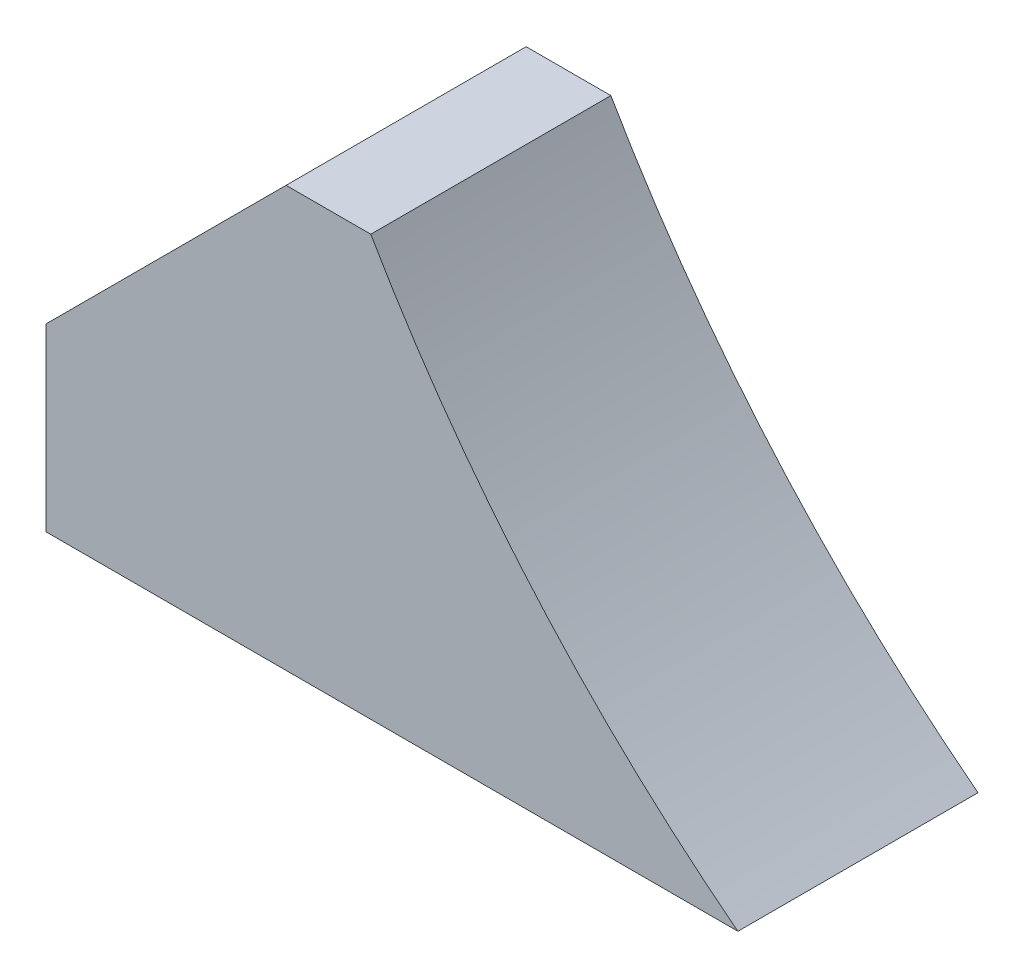
ISO-10303-21;
HEADER;
FILE_DESCRIPTION(('STEP AP214'),'2;1');
FILE_NAME('part.step','',(''),(''),'','','');
FILE_SCHEMA(('AUTOMOTIVE_DESIGN { 1 0 10303 214 1 1 1 1 }'));
ENDSEC;
DATA;
#1=APPLICATION_CONTEXT('core data for automotive mechanical design processes');
#2=APPLICATION_PROTOCOL_DEFINITION('international standard','automotive_design',2000,#1);
#3=PRODUCT_CONTEXT('',#1,'mechanical');
#4=PRODUCT('Part','Part','',(#3));
#5=PRODUCT_RELATED_PRODUCT_CATEGORY('part','',(#4));
#6=PRODUCT_DEFINITION_FORMATION('','',#4);
#7=PRODUCT_DEFINITION_CONTEXT('part definition',#1,'design');
#8=PRODUCT_DEFINITION('design','',#6,#7);
#9=PRODUCT_DEFINITION_SHAPE('','',#8);
#10=(LENGTH_UNIT() NAMED_UNIT(*) SI_UNIT(.MILLI.,.METRE.));
#11=(NAMED_UNIT(*) PLANE_ANGLE_UNIT() SI_UNIT($,.RADIAN.));
#12=(NAMED_UNIT(*) SI_UNIT($,.STERADIAN.) SOLID_ANGLE_UNIT());
#13=UNCERTAINTY_MEASURE_WITH_UNIT(LENGTH_MEASURE(1.E-05),#10,'distance_accuracy_value','');
#14=(GEOMETRIC_REPRESENTATION_CONTEXT(3) GLOBAL_UNCERTAINTY_ASSIGNED_CONTEXT((#13)) GLOBAL_UNIT_ASSIGNED_CONTEXT((#10,
#11,#12)) REPRESENTATION_CONTEXT('',''));
#15=CARTESIAN_POINT('',(0.,0.,0.));
#16=DIRECTION('',(0.,0.,1.));
#17=DIRECTION('',(1.,0.,0.));
#18=AXIS2_PLACEMENT_3D('',#15,#16,#17);
#19=CARTESIAN_POINT('',(64.758308061251,126.954794677147,-25.4));
#20=DIRECTION('',(0.,0.,1.));
#21=DIRECTION('',(1.,0.,0.));
#22=AXIS2_PLACEMENT_3D('',#19,#20,#21);
#23=CYLINDRICAL_SURFACE('',#22,152.390970058818);
#24=CARTESIAN_POINT('',(64.758308061251,126.954794677147,0.));
#25=DIRECTION('',(0.,0.,-1.));
#26=DIRECTION('',(-1.,0.,0.));
#27=AXIS2_PLACEMENT_3D('',#24,#25,#26);
#28=CIRCLE('',#27,152.390970058818);
#29=CARTESIAN_POINT('',(-28.3947447945238,6.35000000000004,0.));
#30=VERTEX_POINT('',#29);
#31=CARTESIAN_POINT('',(-67.2396275405953,50.8,0.));
#32=VERTEX_POINT('',#31);
#33=EDGE_CURVE('E110',#30,#32,#28,.T.);
#34=ORIENTED_EDGE('',*,*,#33,.F.);
#35=DIRECTION('',(0.,0.,1.));
#36=VECTOR('',#35,1.);
#37=CARTESIAN_POINT('',(-28.3947447945238,6.35000000000004,-25.4));
#38=LINE('',#37,#36);
#39=CARTESIAN_POINT('',(-28.3947447945238,6.35000000000004,-25.4));
#40=VERTEX_POINT('',#39);
#41=EDGE_CURVE('E101',#40,#30,#38,.T.);
#42=ORIENTED_EDGE('',*,*,#41,.F.);
#43=CARTESIAN_POINT('',(64.758308061251,126.954794677147,-25.4));
#44=DIRECTION('',(0.,0.,-1.));
#45=DIRECTION('',(-1.,0.,0.));
#46=AXIS2_PLACEMENT_3D('',#43,#44,#45);
#47=CIRCLE('',#46,152.390970058818);
#48=CARTESIAN_POINT('',(-67.2396275405953,50.8,-25.4));
#49=VERTEX_POINT('',#48);
#50=EDGE_CURVE('E96',#40,#49,#47,.T.);
#51=ORIENTED_EDGE('',*,*,#50,.T.);
#52=DIRECTION('',(0.,0.,1.));
#53=VECTOR('',#52,1.);
#54=CARTESIAN_POINT('',(-67.2396275405953,50.8,-25.4));
#55=LINE('',#54,#53);
#56=EDGE_CURVE('E78',#49,#32,#55,.T.);
#57=ORIENTED_EDGE('',*,*,#56,.T.);
#58=EDGE_LOOP('',(#34,#42,#51,#57));
#59=FACE_BOUND('',#58,.T.);
#60=ADVANCED_FACE('F33',(#59),#23,.F.);
#61=CARTESIAN_POINT('',(-28.3947447945238,6.35000000000004,-25.4));
#62=DIRECTION('',(0.,-1.,0.));
#63=DIRECTION('',(1.,0.,0.));
#64=AXIS2_PLACEMENT_3D('',#61,#62,#63);
#65=PLANE('',#64);
#66=DIRECTION('',(1.,0.,0.));
#67=VECTOR('',#66,1.);
#68=CARTESIAN_POINT('',(-28.3947447945238,6.35000000000004,0.));
#69=LINE('',#68,#67);
#70=CARTESIAN_POINT('',(-101.6,6.35000000000001,0.));
#71=VERTEX_POINT('',#70);
#72=EDGE_CURVE('E102',#71,#30,#69,.T.);
#73=ORIENTED_EDGE('',*,*,#72,.F.);
#74=DIRECTION('',(0.,0.,1.));
#75=VECTOR('',#74,1.);
#76=CARTESIAN_POINT('',(-101.6,6.35000000000001,-25.4));
#77=LINE('',#76,#75);
#78=CARTESIAN_POINT('',(-101.6,6.35000000000001,-25.4));
#79=VERTEX_POINT('',#78);
#80=EDGE_CURVE('E89',#79,#71,#77,.T.);
#81=ORIENTED_EDGE('',*,*,#80,.F.);
#82=DIRECTION('',(1.,0.,0.));
#83=VECTOR('',#82,1.);
#84=CARTESIAN_POINT('',(-28.3947447945238,6.35000000000004,-25.4));
#85=LINE('',#84,#83);
#86=EDGE_CURVE('E90',#79,#40,#85,.T.);
#87=ORIENTED_EDGE('',*,*,#86,.T.);
#88=ORIENTED_EDGE('',*,*,#41,.T.);
#89=EDGE_LOOP('',(#73,#81,#87,#88));
#90=FACE_BOUND('',#89,.T.);
#91=ADVANCED_FACE('F124',(#90),#65,.T.);
#92=CARTESIAN_POINT('',(-101.6,6.35000000000001,-25.4));
#93=DIRECTION('',(-1.,0.,0.));
#94=DIRECTION('',(0.,0.,1.));
#95=AXIS2_PLACEMENT_3D('',#92,#93,#94);
#96=PLANE('',#95);
#97=DIRECTION('',(0.,-1.,0.));
#98=VECTOR('',#97,1.);
#99=CARTESIAN_POINT('',(-101.6,6.35000000000001,0.));
#100=LINE('',#99,#98);
#101=CARTESIAN_POINT('',(-101.6,25.3999999999999,0.));
#102=VERTEX_POINT('',#101);
#103=EDGE_CURVE('E105',#102,#71,#100,.T.);
#104=ORIENTED_EDGE('',*,*,#103,.F.);
#105=DIRECTION('',(0.,0.,-1.));
#106=VECTOR('',#105,1.);
#107=CARTESIAN_POINT('',(-101.6,25.3999999999999,-25.4));
#108=LINE('',#107,#106);
#109=CARTESIAN_POINT('',(-101.6,25.3999999999999,-25.4));
#110=VERTEX_POINT('',#109);
#111=EDGE_CURVE('E41',#102,#110,#108,.T.);
#112=ORIENTED_EDGE('',*,*,#111,.T.);
#113=DIRECTION('',(0.,-1.,0.));
#114=VECTOR('',#113,1.);
#115=CARTESIAN_POINT('',(-101.6,6.35000000000001,-25.4));
#116=LINE('',#115,#114);
#117=EDGE_CURVE('E99',#110,#79,#116,.T.);
#118=ORIENTED_EDGE('',*,*,#117,.T.);
#119=ORIENTED_EDGE('',*,*,#80,.T.);
#120=EDGE_LOOP('',(#104,#112,#118,#119));
#121=FACE_BOUND('',#120,.T.);
#122=ADVANCED_FACE('F134',(#121),#96,.T.);
#123=CARTESIAN_POINT('',(-101.6,50.8,-25.4));
#124=DIRECTION('',(0.,1.,0.));
#125=DIRECTION('',(0.,0.,1.));
#126=AXIS2_PLACEMENT_3D('',#123,#124,#125);
#127=PLANE('',#126);
#128=DIRECTION('',(-1.,0.,0.));
#129=VECTOR('',#128,1.);
#130=CARTESIAN_POINT('',(-101.6,50.8,-25.4));
#131=LINE('',#130,#129);
#132=CARTESIAN_POINT('',(-76.2000000000001,50.8,-25.4));
#133=VERTEX_POINT('',#132);
#134=EDGE_CURVE('E82',#49,#133,#131,.T.);
#135=ORIENTED_EDGE('',*,*,#134,.T.);
#136=DIRECTION('',(0.,0.,1.));
#137=VECTOR('',#136,1.);
#138=CARTESIAN_POINT('',(-76.2,50.8,-25.4));
#139=LINE('',#138,#137);
#140=CARTESIAN_POINT('',(-76.2,50.8,0.));
#141=VERTEX_POINT('',#140);
#142=EDGE_CURVE('E115',#133,#141,#139,.T.);
#143=ORIENTED_EDGE('',*,*,#142,.T.);
#144=DIRECTION('',(-1.,0.,0.));
#145=VECTOR('',#144,1.);
#146=CARTESIAN_POINT('',(-101.6,50.8,0.));
#147=LINE('',#146,#145);
#148=EDGE_CURVE('E84',#32,#141,#147,.T.);
#149=ORIENTED_EDGE('',*,*,#148,.F.);
#150=ORIENTED_EDGE('',*,*,#56,.F.);
#151=EDGE_LOOP('',(#135,#143,#149,#150));
#152=FACE_BOUND('',#151,.T.);
#153=ADVANCED_FACE('F80',(#152),#127,.T.);
#154=CARTESIAN_POINT('',(64.758308061251,126.954794677147,-25.4));
#155=DIRECTION('',(0.,0.,-1.));
#156=DIRECTION('',(-1.,0.,0.));
#157=AXIS2_PLACEMENT_3D('',#154,#155,#156);
#158=PLANE('',#157);
#159=ORIENTED_EDGE('',*,*,#117,.F.);
#160=DIRECTION('',(-0.707106781186546,-0.707106781186549,0.));
#161=VECTOR('',#160,1.);
#162=CARTESIAN_POINT('',(32.3565513691988,159.356551369199,-25.4));
#163=LINE('',#162,#161);
#164=EDGE_CURVE('E11',#110,#133,#163,.F.);
#165=ORIENTED_EDGE('',*,*,#164,.T.);
#166=ORIENTED_EDGE('',*,*,#134,.F.);
#167=ORIENTED_EDGE('',*,*,#50,.F.);
#168=ORIENTED_EDGE('',*,*,#86,.F.);
#169=EDGE_LOOP('',(#159,#165,#166,#167,#168));
#170=FACE_BOUND('',#169,.T.);
#171=ADVANCED_FACE('F94',(#170),#158,.T.);
#172=CARTESIAN_POINT('',(64.758308061251,126.954794677147,0.));
#173=DIRECTION('',(0.,0.,-1.));
#174=DIRECTION('',(-1.,0.,0.));
#175=AXIS2_PLACEMENT_3D('',#172,#173,#174);
#176=PLANE('',#175);
#177=ORIENTED_EDGE('',*,*,#148,.T.);
#178=DIRECTION('',(0.707106781186546,0.707106781186549,0.));
#179=VECTOR('',#178,1.);
#180=CARTESIAN_POINT('',(-76.2,50.8,0.));
#181=LINE('',#180,#179);
#182=EDGE_CURVE('E55',#141,#102,#181,.F.);
#183=ORIENTED_EDGE('',*,*,#182,.T.);
#184=ORIENTED_EDGE('',*,*,#103,.T.);
#185=ORIENTED_EDGE('',*,*,#72,.T.);
#186=ORIENTED_EDGE('',*,*,#33,.T.);
#187=EDGE_LOOP('',(#177,#183,#184,#185,#186));
#188=FACE_BOUND('',#187,.T.);
#189=ADVANCED_FACE('F120',(#188),#176,.F.);
#190=CARTESIAN_POINT('',(-76.2,50.8,-25.4));
#191=DIRECTION('',(0.707106781186549,-0.707106781186546,0.));
#192=DIRECTION('',(0.,0.,1.));
#193=AXIS2_PLACEMENT_3D('',#190,#191,#192);
#194=PLANE('',#193);
#195=ORIENTED_EDGE('',*,*,#164,.F.);
#196=ORIENTED_EDGE('',*,*,#111,.F.);
#197=ORIENTED_EDGE('',*,*,#182,.F.);
#198=ORIENTED_EDGE('',*,*,#142,.F.);
#199=EDGE_LOOP('',(#195,#196,#197,#198));
#200=FACE_BOUND('',#199,.T.);
#201=ADVANCED_FACE('F35',(#200),#194,.F.);
#202=CLOSED_SHELL('',(#60,#91,#122,#153,#171,#189,#201));
#203=MANIFOLD_SOLID_BREP('B2',#202);
#204=ADVANCED_BREP_SHAPE_REPRESENTATION('',(#18,#203),#14);
#205=SHAPE_DEFINITION_REPRESENTATION(#9,#204);
ENDSEC;
END-ISO-10303-21;
